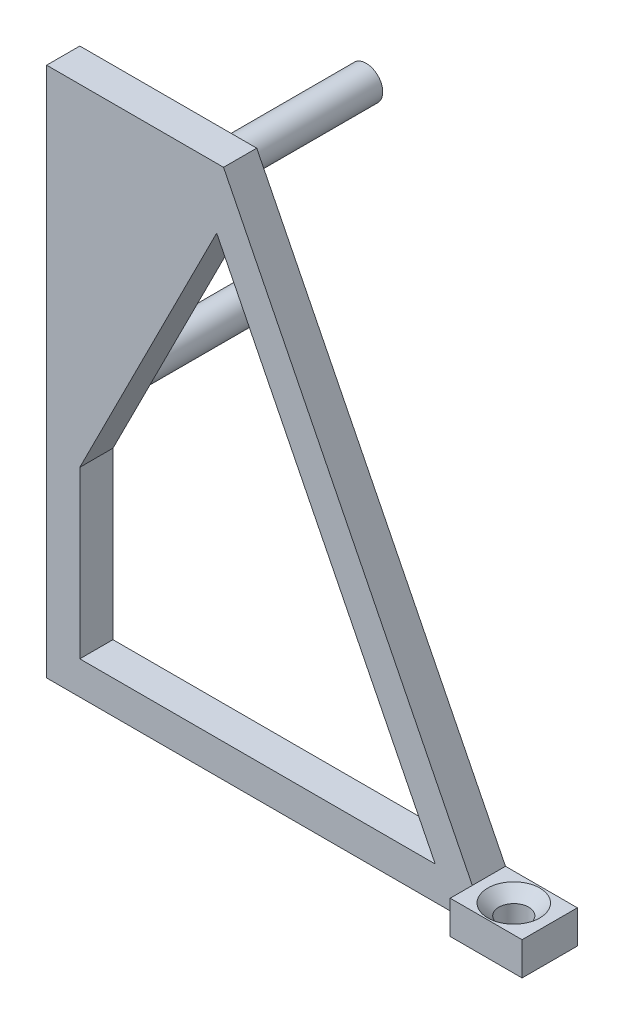
ISO-10303-21;
HEADER;
FILE_DESCRIPTION(('STEP AP214'),'2;1');
FILE_NAME('part.step','',(''),(''),'','','');
FILE_SCHEMA(('AUTOMOTIVE_DESIGN { 1 0 10303 214 1 1 1 1 }'));
ENDSEC;
DATA;
#1=APPLICATION_CONTEXT('core data for automotive mechanical design processes');
#2=APPLICATION_PROTOCOL_DEFINITION('international standard','automotive_design',2000,#1);
#3=PRODUCT_CONTEXT('',#1,'mechanical');
#4=PRODUCT('Part','Part','',(#3));
#5=PRODUCT_RELATED_PRODUCT_CATEGORY('part','',(#4));
#6=PRODUCT_DEFINITION_FORMATION('','',#4);
#7=PRODUCT_DEFINITION_CONTEXT('part definition',#1,'design');
#8=PRODUCT_DEFINITION('design','',#6,#7);
#9=PRODUCT_DEFINITION_SHAPE('','',#8);
#10=(LENGTH_UNIT() NAMED_UNIT(*) SI_UNIT(.MILLI.,.METRE.));
#11=(NAMED_UNIT(*) PLANE_ANGLE_UNIT() SI_UNIT($,.RADIAN.));
#12=(NAMED_UNIT(*) SI_UNIT($,.STERADIAN.) SOLID_ANGLE_UNIT());
#13=UNCERTAINTY_MEASURE_WITH_UNIT(LENGTH_MEASURE(1.E-05),#10,'distance_accuracy_value','');
#14=(GEOMETRIC_REPRESENTATION_CONTEXT(3) GLOBAL_UNCERTAINTY_ASSIGNED_CONTEXT((#13)) GLOBAL_UNIT_ASSIGNED_CONTEXT((#10,
#11,#12)) REPRESENTATION_CONTEXT('',''));
#15=CARTESIAN_POINT('',(0.,0.,0.));
#16=DIRECTION('',(0.,0.,1.));
#17=DIRECTION('',(1.,0.,0.));
#18=AXIS2_PLACEMENT_3D('',#15,#16,#17);
#19=CARTESIAN_POINT('',(0.,0.,3.));
#20=DIRECTION('',(0.,0.,1.));
#21=DIRECTION('',(1.,0.,0.));
#22=AXIS2_PLACEMENT_3D('',#19,#20,#21);
#23=PLANE('',#22);
#24=DIRECTION('',(0.,-1.,0.));
#25=VECTOR('',#24,1.);
#26=CARTESIAN_POINT('',(38.5,3.,3.));
#27=LINE('',#26,#25);
#28=CARTESIAN_POINT('',(38.5,2.99999999999999,3.));
#29=VERTEX_POINT('',#28);
#30=CARTESIAN_POINT('',(38.5,0.,3.));
#31=VERTEX_POINT('',#30);
#32=EDGE_CURVE('E151',#29,#31,#27,.T.);
#33=ORIENTED_EDGE('',*,*,#32,.F.);
#34=DIRECTION('',(-0.447213595499958,0.894427190999916,0.));
#35=VECTOR('',#34,1.);
#36=CARTESIAN_POINT('',(16.,48.,3.));
#37=LINE('',#36,#35);
#38=CARTESIAN_POINT('',(16.,48.,3.));
#39=VERTEX_POINT('',#38);
#40=EDGE_CURVE('E204',#29,#39,#37,.T.);
#41=ORIENTED_EDGE('',*,*,#40,.T.);
#42=DIRECTION('',(-1.,0.,0.));
#43=VECTOR('',#42,1.);
#44=CARTESIAN_POINT('',(0.,48.,3.));
#45=LINE('',#44,#43);
#46=CARTESIAN_POINT('',(0.,48.,3.));
#47=VERTEX_POINT('',#46);
#48=EDGE_CURVE('E207',#39,#47,#45,.T.);
#49=ORIENTED_EDGE('',*,*,#48,.T.);
#50=DIRECTION('',(0.,-1.,0.));
#51=VECTOR('',#50,1.);
#52=CARTESIAN_POINT('',(0.,0.,3.));
#53=LINE('',#52,#51);
#54=CARTESIAN_POINT('',(0.,0.,3.));
#55=VERTEX_POINT('',#54);
#56=EDGE_CURVE('E209',#47,#55,#53,.T.);
#57=ORIENTED_EDGE('',*,*,#56,.T.);
#58=DIRECTION('',(1.,0.,0.));
#59=VECTOR('',#58,1.);
#60=CARTESIAN_POINT('',(0.,0.,3.));
#61=LINE('',#60,#59);
#62=EDGE_CURVE('E202',#55,#31,#61,.T.);
#63=ORIENTED_EDGE('',*,*,#62,.T.);
#64=EDGE_LOOP('',(#33,#41,#49,#57,#63));
#65=FACE_BOUND('',#64,.T.);
#66=DIRECTION('',(1.,0.,0.));
#67=VECTOR('',#66,1.);
#68=CARTESIAN_POINT('',(3.,3.,3.));
#69=LINE('',#68,#67);
#70=CARTESIAN_POINT('',(3.,3.,3.));
#71=VERTEX_POINT('',#70);
#72=CARTESIAN_POINT('',(35.1458980337503,3.,3.));
#73=VERTEX_POINT('',#72);
#74=EDGE_CURVE('E178',#71,#73,#69,.T.);
#75=ORIENTED_EDGE('',*,*,#74,.F.);
#76=DIRECTION('',(0.,-1.,0.));
#77=VECTOR('',#76,1.);
#78=CARTESIAN_POINT('',(3.,3.,3.));
#79=LINE('',#78,#77);
#80=CARTESIAN_POINT('',(3.,18.,3.));
#81=VERTEX_POINT('',#80);
#82=EDGE_CURVE('E176',#81,#71,#79,.T.);
#83=ORIENTED_EDGE('',*,*,#82,.F.);
#84=DIRECTION('',(-0.450431679441175,-0.892810899438287,0.));
#85=VECTOR('',#84,1.);
#86=CARTESIAN_POINT('',(3.,18.,3.));
#87=LINE('',#86,#85);
#88=CARTESIAN_POINT('',(15.3782712398091,42.5352535878825,3.));
#89=VERTEX_POINT('',#88);
#90=EDGE_CURVE('E183',#89,#81,#87,.T.);
#91=ORIENTED_EDGE('',*,*,#90,.F.);
#92=DIRECTION('',(-0.447213595499958,0.894427190999916,0.));
#93=VECTOR('',#92,1.);
#94=CARTESIAN_POINT('',(15.3782712398091,42.5352535878825,3.));
#95=LINE('',#94,#93);
#96=EDGE_CURVE('E181',#73,#89,#95,.T.);
#97=ORIENTED_EDGE('',*,*,#96,.F.);
#98=EDGE_LOOP('',(#75,#83,#91,#97));
#99=FACE_BOUND('',#98,.T.);
#100=ADVANCED_FACE('F35',(#65,#99),#23,.T.);
#101=CARTESIAN_POINT('',(0.,0.,0.));
#102=DIRECTION('',(0.,0.,1.));
#103=DIRECTION('',(1.,0.,0.));
#104=AXIS2_PLACEMENT_3D('',#101,#102,#103);
#105=PLANE('',#104);
#106=DIRECTION('',(1.,0.,0.));
#107=VECTOR('',#106,1.);
#108=CARTESIAN_POINT('',(40.,0.,0.));
#109=LINE('',#108,#107);
#110=CARTESIAN_POINT('',(0.,0.,0.));
#111=VERTEX_POINT('',#110);
#112=CARTESIAN_POINT('',(45.,0.,0.));
#113=VERTEX_POINT('',#112);
#114=EDGE_CURVE('E201',#111,#113,#109,.T.);
#115=ORIENTED_EDGE('',*,*,#114,.F.);
#116=DIRECTION('',(0.,-1.,0.));
#117=VECTOR('',#116,1.);
#118=CARTESIAN_POINT('',(0.,0.,0.));
#119=LINE('',#118,#117);
#120=CARTESIAN_POINT('',(0.,48.,0.));
#121=VERTEX_POINT('',#120);
#122=EDGE_CURVE('E205',#121,#111,#119,.T.);
#123=ORIENTED_EDGE('',*,*,#122,.F.);
#124=DIRECTION('',(-1.,0.,0.));
#125=VECTOR('',#124,1.);
#126=CARTESIAN_POINT('',(0.,48.,0.));
#127=LINE('',#126,#125);
#128=CARTESIAN_POINT('',(16.,48.,0.));
#129=VERTEX_POINT('',#128);
#130=EDGE_CURVE('E218',#129,#121,#127,.T.);
#131=ORIENTED_EDGE('',*,*,#130,.F.);
#132=DIRECTION('',(-0.447213595499958,0.894427190999916,0.));
#133=VECTOR('',#132,1.);
#134=CARTESIAN_POINT('',(16.,48.,0.));
#135=LINE('',#134,#133);
#136=CARTESIAN_POINT('',(38.5,2.99999999999999,0.));
#137=VERTEX_POINT('',#136);
#138=EDGE_CURVE('E216',#137,#129,#135,.T.);
#139=ORIENTED_EDGE('',*,*,#138,.F.);
#140=DIRECTION('',(-1.,0.,0.));
#141=VECTOR('',#140,1.);
#142=CARTESIAN_POINT('',(45.,3.,0.));
#143=LINE('',#142,#141);
#144=CARTESIAN_POINT('',(45.,3.,0.));
#145=VERTEX_POINT('',#144);
#146=EDGE_CURVE('E214',#145,#137,#143,.T.);
#147=ORIENTED_EDGE('',*,*,#146,.F.);
#148=DIRECTION('',(0.,1.,0.));
#149=VECTOR('',#148,1.);
#150=CARTESIAN_POINT('',(45.,0.,0.));
#151=LINE('',#150,#149);
#152=EDGE_CURVE('E131',#113,#145,#151,.T.);
#153=ORIENTED_EDGE('',*,*,#152,.F.);
#154=EDGE_LOOP('',(#115,#123,#131,#139,#147,#153));
#155=FACE_BOUND('',#154,.T.);
#156=DIRECTION('',(0.,-1.,0.));
#157=VECTOR('',#156,1.);
#158=CARTESIAN_POINT('',(3.,3.,0.));
#159=LINE('',#158,#157);
#160=CARTESIAN_POINT('',(3.,18.,0.));
#161=VERTEX_POINT('',#160);
#162=CARTESIAN_POINT('',(3.,3.,0.));
#163=VERTEX_POINT('',#162);
#164=EDGE_CURVE('E59',#161,#163,#159,.T.);
#165=ORIENTED_EDGE('',*,*,#164,.T.);
#166=DIRECTION('',(1.,0.,0.));
#167=VECTOR('',#166,1.);
#168=CARTESIAN_POINT('',(3.,3.,0.));
#169=LINE('',#168,#167);
#170=CARTESIAN_POINT('',(35.1458980337503,3.,0.));
#171=VERTEX_POINT('',#170);
#172=EDGE_CURVE('E187',#163,#171,#169,.T.);
#173=ORIENTED_EDGE('',*,*,#172,.T.);
#174=DIRECTION('',(-0.447213595499958,0.894427190999916,0.));
#175=VECTOR('',#174,1.);
#176=CARTESIAN_POINT('',(15.3782712398091,42.5352535878825,0.));
#177=LINE('',#176,#175);
#178=CARTESIAN_POINT('',(15.3782712398091,42.5352535878825,0.));
#179=VERTEX_POINT('',#178);
#180=EDGE_CURVE('E190',#171,#179,#177,.T.);
#181=ORIENTED_EDGE('',*,*,#180,.T.);
#182=DIRECTION('',(-0.450431679441175,-0.892810899438287,0.));
#183=VECTOR('',#182,1.);
#184=CARTESIAN_POINT('',(3.,18.,0.));
#185=LINE('',#184,#183);
#186=EDGE_CURVE('E179',#179,#161,#185,.T.);
#187=ORIENTED_EDGE('',*,*,#186,.T.);
#188=EDGE_LOOP('',(#165,#173,#181,#187));
#189=FACE_BOUND('',#188,.T.);
#190=CARTESIAN_POINT('',(12.9,45.1,0.));
#191=DIRECTION('',(0.,0.,1.));
#192=DIRECTION('',(1.,0.,0.));
#193=AXIS2_PLACEMENT_3D('',#190,#191,#192);
#194=CIRCLE('',#193,1.5);
#195=CARTESIAN_POINT('',(14.4,45.1,0.));
#196=VERTEX_POINT('',#195);
#197=EDGE_CURVE('E173',#196,#196,#194,.T.);
#198=ORIENTED_EDGE('',*,*,#197,.T.);
#199=EDGE_LOOP('',(#198));
#200=FACE_BOUND('',#199,.T.);
#201=CARTESIAN_POINT('',(2.5,22.9,0.));
#202=DIRECTION('',(0.,0.,1.));
#203=DIRECTION('',(1.,0.,0.));
#204=AXIS2_PLACEMENT_3D('',#201,#202,#203);
#205=CIRCLE('',#204,1.5);
#206=CARTESIAN_POINT('',(4.,22.9,0.));
#207=VERTEX_POINT('',#206);
#208=EDGE_CURVE('E167',#207,#207,#205,.T.);
#209=ORIENTED_EDGE('',*,*,#208,.T.);
#210=EDGE_LOOP('',(#209));
#211=FACE_BOUND('',#210,.T.);
#212=ADVANCED_FACE('F246',(#155,#189,#200,#211),#105,.F.);
#213=CARTESIAN_POINT('',(40.,0.,3.));
#214=DIRECTION('',(0.,1.,0.));
#215=DIRECTION('',(0.,0.,1.));
#216=AXIS2_PLACEMENT_3D('',#213,#214,#215);
#217=PLANE('',#216);
#218=CARTESIAN_POINT('',(41.75,0.,2.5));
#219=DIRECTION('',(0.,1.,0.));
#220=DIRECTION('',(-1.,0.,0.));
#221=AXIS2_PLACEMENT_3D('',#218,#219,#220);
#222=CIRCLE('',#221,1.35);
#223=CARTESIAN_POINT('',(40.4,0.,2.5));
#224=VERTEX_POINT('',#223);
#225=EDGE_CURVE('E154',#224,#224,#222,.T.);
#226=ORIENTED_EDGE('',*,*,#225,.T.);
#227=EDGE_LOOP('',(#226));
#228=FACE_BOUND('',#227,.T.);
#229=ORIENTED_EDGE('',*,*,#114,.T.);
#230=DIRECTION('',(0.,0.,-1.));
#231=VECTOR('',#230,1.);
#232=CARTESIAN_POINT('',(45.,0.,3.));
#233=LINE('',#232,#231);
#234=CARTESIAN_POINT('',(45.,0.,5.));
#235=VERTEX_POINT('',#234);
#236=EDGE_CURVE('E134',#235,#113,#233,.T.);
#237=ORIENTED_EDGE('',*,*,#236,.F.);
#238=DIRECTION('',(1.,0.,0.));
#239=VECTOR('',#238,1.);
#240=CARTESIAN_POINT('',(45.,0.,5.));
#241=LINE('',#240,#239);
#242=CARTESIAN_POINT('',(38.5,0.,5.));
#243=VERTEX_POINT('',#242);
#244=EDGE_CURVE('E150',#243,#235,#241,.T.);
#245=ORIENTED_EDGE('',*,*,#244,.F.);
#246=DIRECTION('',(0.,0.,-1.));
#247=VECTOR('',#246,1.);
#248=CARTESIAN_POINT('',(38.5,0.,5.));
#249=LINE('',#248,#247);
#250=EDGE_CURVE('E159',#243,#31,#249,.T.);
#251=ORIENTED_EDGE('',*,*,#250,.T.);
#252=ORIENTED_EDGE('',*,*,#62,.F.);
#253=DIRECTION('',(0.,0.,-1.));
#254=VECTOR('',#253,1.);
#255=CARTESIAN_POINT('',(0.,0.,3.));
#256=LINE('',#255,#254);
#257=EDGE_CURVE('E211',#55,#111,#256,.T.);
#258=ORIENTED_EDGE('',*,*,#257,.T.);
#259=EDGE_LOOP('',(#229,#237,#245,#251,#252,#258));
#260=FACE_BOUND('',#259,.T.);
#261=ADVANCED_FACE('F252',(#228,#260),#217,.F.);
#262=CARTESIAN_POINT('',(45.,0.,3.));
#263=DIRECTION('',(-1.,0.,0.));
#264=DIRECTION('',(0.,0.,1.));
#265=AXIS2_PLACEMENT_3D('',#262,#263,#264);
#266=PLANE('',#265);
#267=ORIENTED_EDGE('',*,*,#152,.T.);
#268=DIRECTION('',(0.,0.,-1.));
#269=VECTOR('',#268,1.);
#270=CARTESIAN_POINT('',(45.,3.,3.));
#271=LINE('',#270,#269);
#272=CARTESIAN_POINT('',(45.,3.,5.));
#273=VERTEX_POINT('',#272);
#274=EDGE_CURVE('E124',#273,#145,#271,.T.);
#275=ORIENTED_EDGE('',*,*,#274,.F.);
#276=DIRECTION('',(0.,1.,0.));
#277=VECTOR('',#276,1.);
#278=CARTESIAN_POINT('',(45.,3.,5.));
#279=LINE('',#278,#277);
#280=EDGE_CURVE('E129',#235,#273,#279,.T.);
#281=ORIENTED_EDGE('',*,*,#280,.F.);
#282=ORIENTED_EDGE('',*,*,#236,.T.);
#283=EDGE_LOOP('',(#267,#275,#281,#282));
#284=FACE_BOUND('',#283,.T.);
#285=ADVANCED_FACE('F126',(#284),#266,.F.);
#286=CARTESIAN_POINT('',(45.,3.,3.));
#287=DIRECTION('',(0.,-1.,0.));
#288=DIRECTION('',(1.,0.,0.));
#289=AXIS2_PLACEMENT_3D('',#286,#287,#288);
#290=PLANE('',#289);
#291=CARTESIAN_POINT('',(41.75,3.,2.5));
#292=DIRECTION('',(0.,-1.,0.));
#293=DIRECTION('',(1.,0.,0.));
#294=AXIS2_PLACEMENT_3D('',#291,#292,#293);
#295=CIRCLE('',#294,2.34999999999999);
#296=CARTESIAN_POINT('',(44.1,3.,2.5));
#297=VERTEX_POINT('',#296);
#298=EDGE_CURVE('E11',#297,#297,#295,.T.);
#299=ORIENTED_EDGE('',*,*,#298,.T.);
#300=EDGE_LOOP('',(#299));
#301=FACE_BOUND('',#300,.T.);
#302=ORIENTED_EDGE('',*,*,#146,.T.);
#303=DIRECTION('',(0.,0.,-1.));
#304=VECTOR('',#303,1.);
#305=CARTESIAN_POINT('',(38.5,2.99999999999999,3.));
#306=LINE('',#305,#304);
#307=EDGE_CURVE('E135',#29,#137,#306,.T.);
#308=ORIENTED_EDGE('',*,*,#307,.F.);
#309=DIRECTION('',(0.,0.,-1.));
#310=VECTOR('',#309,1.);
#311=CARTESIAN_POINT('',(38.5,3.,5.));
#312=LINE('',#311,#310);
#313=CARTESIAN_POINT('',(38.5,3.,5.));
#314=VERTEX_POINT('',#313);
#315=EDGE_CURVE('E142',#314,#29,#312,.T.);
#316=ORIENTED_EDGE('',*,*,#315,.F.);
#317=DIRECTION('',(-1.,0.,0.));
#318=VECTOR('',#317,1.);
#319=CARTESIAN_POINT('',(45.,3.,5.));
#320=LINE('',#319,#318);
#321=EDGE_CURVE('E138',#273,#314,#320,.T.);
#322=ORIENTED_EDGE('',*,*,#321,.F.);
#323=ORIENTED_EDGE('',*,*,#274,.T.);
#324=EDGE_LOOP('',(#302,#308,#316,#322,#323));
#325=FACE_BOUND('',#324,.T.);
#326=ADVANCED_FACE('F139',(#301,#325),#290,.F.);
#327=CARTESIAN_POINT('',(16.,48.,3.));
#328=DIRECTION('',(-0.894427190999916,-0.447213595499958,0.));
#329=DIRECTION('',(0.447213595499958,-0.894427190999916,0.));
#330=AXIS2_PLACEMENT_3D('',#327,#328,#329);
#331=PLANE('',#330);
#332=ORIENTED_EDGE('',*,*,#138,.T.);
#333=DIRECTION('',(0.,0.,-1.));
#334=VECTOR('',#333,1.);
#335=CARTESIAN_POINT('',(16.,48.,3.));
#336=LINE('',#335,#334);
#337=EDGE_CURVE('E227',#39,#129,#336,.T.);
#338=ORIENTED_EDGE('',*,*,#337,.F.);
#339=ORIENTED_EDGE('',*,*,#40,.F.);
#340=ORIENTED_EDGE('',*,*,#307,.T.);
#341=EDGE_LOOP('',(#332,#338,#339,#340));
#342=FACE_BOUND('',#341,.T.);
#343=ADVANCED_FACE('F267',(#342),#331,.F.);
#344=CARTESIAN_POINT('',(0.,48.,3.));
#345=DIRECTION('',(0.,-1.,0.));
#346=DIRECTION('',(0.,0.,-1.));
#347=AXIS2_PLACEMENT_3D('',#344,#345,#346);
#348=PLANE('',#347);
#349=ORIENTED_EDGE('',*,*,#130,.T.);
#350=DIRECTION('',(0.,0.,-1.));
#351=VECTOR('',#350,1.);
#352=CARTESIAN_POINT('',(0.,48.,3.));
#353=LINE('',#352,#351);
#354=EDGE_CURVE('E224',#47,#121,#353,.T.);
#355=ORIENTED_EDGE('',*,*,#354,.F.);
#356=ORIENTED_EDGE('',*,*,#48,.F.);
#357=ORIENTED_EDGE('',*,*,#337,.T.);
#358=EDGE_LOOP('',(#349,#355,#356,#357));
#359=FACE_BOUND('',#358,.T.);
#360=ADVANCED_FACE('F263',(#359),#348,.F.);
#361=CARTESIAN_POINT('',(0.,0.,3.));
#362=DIRECTION('',(1.,0.,0.));
#363=DIRECTION('',(0.,0.,-1.));
#364=AXIS2_PLACEMENT_3D('',#361,#362,#363);
#365=PLANE('',#364);
#366=ORIENTED_EDGE('',*,*,#122,.T.);
#367=ORIENTED_EDGE('',*,*,#257,.F.);
#368=ORIENTED_EDGE('',*,*,#56,.F.);
#369=ORIENTED_EDGE('',*,*,#354,.T.);
#370=EDGE_LOOP('',(#366,#367,#368,#369));
#371=FACE_BOUND('',#370,.T.);
#372=ADVANCED_FACE('F260',(#371),#365,.F.);
#373=CARTESIAN_POINT('',(3.,3.,3.));
#374=DIRECTION('',(1.,0.,0.));
#375=DIRECTION('',(0.,0.,-1.));
#376=AXIS2_PLACEMENT_3D('',#373,#374,#375);
#377=PLANE('',#376);
#378=ORIENTED_EDGE('',*,*,#164,.F.);
#379=DIRECTION('',(0.,0.,-1.));
#380=VECTOR('',#379,1.);
#381=CARTESIAN_POINT('',(3.,18.,3.));
#382=LINE('',#381,#380);
#383=EDGE_CURVE('E185',#81,#161,#382,.T.);
#384=ORIENTED_EDGE('',*,*,#383,.F.);
#385=ORIENTED_EDGE('',*,*,#82,.T.);
#386=DIRECTION('',(0.,0.,-1.));
#387=VECTOR('',#386,1.);
#388=CARTESIAN_POINT('',(3.,3.,3.));
#389=LINE('',#388,#387);
#390=EDGE_CURVE('E199',#71,#163,#389,.T.);
#391=ORIENTED_EDGE('',*,*,#390,.T.);
#392=EDGE_LOOP('',(#378,#384,#385,#391));
#393=FACE_BOUND('',#392,.T.);
#394=ADVANCED_FACE('F257',(#393),#377,.T.);
#395=CARTESIAN_POINT('',(3.,3.,3.));
#396=DIRECTION('',(0.,1.,0.));
#397=DIRECTION('',(0.,0.,1.));
#398=AXIS2_PLACEMENT_3D('',#395,#396,#397);
#399=PLANE('',#398);
#400=ORIENTED_EDGE('',*,*,#172,.F.);
#401=ORIENTED_EDGE('',*,*,#390,.F.);
#402=ORIENTED_EDGE('',*,*,#74,.T.);
#403=DIRECTION('',(0.,0.,-1.));
#404=VECTOR('',#403,1.);
#405=CARTESIAN_POINT('',(35.1458980337503,3.,3.));
#406=LINE('',#405,#404);
#407=EDGE_CURVE('E197',#73,#171,#406,.T.);
#408=ORIENTED_EDGE('',*,*,#407,.T.);
#409=EDGE_LOOP('',(#400,#401,#402,#408));
#410=FACE_BOUND('',#409,.T.);
#411=ADVANCED_FACE('F325',(#410),#399,.T.);
#412=CARTESIAN_POINT('',(15.3782712398091,42.5352535878825,3.));
#413=DIRECTION('',(-0.894427190999916,-0.447213595499958,0.));
#414=DIRECTION('',(0.447213595499958,-0.894427190999916,0.));
#415=AXIS2_PLACEMENT_3D('',#412,#413,#414);
#416=PLANE('',#415);
#417=ORIENTED_EDGE('',*,*,#180,.F.);
#418=ORIENTED_EDGE('',*,*,#407,.F.);
#419=ORIENTED_EDGE('',*,*,#96,.T.);
#420=DIRECTION('',(0.,0.,-1.));
#421=VECTOR('',#420,1.);
#422=CARTESIAN_POINT('',(15.3782712398091,42.5352535878825,3.));
#423=LINE('',#422,#421);
#424=EDGE_CURVE('E51',#89,#179,#423,.T.);
#425=ORIENTED_EDGE('',*,*,#424,.T.);
#426=EDGE_LOOP('',(#417,#418,#419,#425));
#427=FACE_BOUND('',#426,.T.);
#428=ADVANCED_FACE('F323',(#427),#416,.T.);
#429=CARTESIAN_POINT('',(3.,18.,3.));
#430=DIRECTION('',(0.892810899438287,-0.450431679441175,0.));
#431=DIRECTION('',(0.450431679441175,0.892810899438287,0.));
#432=AXIS2_PLACEMENT_3D('',#429,#430,#431);
#433=PLANE('',#432);
#434=ORIENTED_EDGE('',*,*,#186,.F.);
#435=ORIENTED_EDGE('',*,*,#424,.F.);
#436=ORIENTED_EDGE('',*,*,#90,.T.);
#437=ORIENTED_EDGE('',*,*,#383,.T.);
#438=EDGE_LOOP('',(#434,#435,#436,#437));
#439=FACE_BOUND('',#438,.T.);
#440=ADVANCED_FACE('F319',(#439),#433,.T.);
#441=CARTESIAN_POINT('',(12.9,45.1,3.));
#442=DIRECTION('',(0.,0.,-1.));
#443=DIRECTION('',(-1.,0.,0.));
#444=AXIS2_PLACEMENT_3D('',#441,#442,#443);
#445=CYLINDRICAL_SURFACE('',#444,1.5);
#446=CARTESIAN_POINT('',(12.9,45.1,-13.));
#447=DIRECTION('',(0.,0.,-1.));
#448=DIRECTION('',(-1.,0.,0.));
#449=AXIS2_PLACEMENT_3D('',#446,#447,#448);
#450=CIRCLE('',#449,1.5);
#451=CARTESIAN_POINT('',(11.4,45.1,-13.));
#452=VERTEX_POINT('',#451);
#453=EDGE_CURVE('E170',#452,#452,#450,.T.);
#454=ORIENTED_EDGE('',*,*,#453,.F.);
#455=EDGE_LOOP('',(#454));
#456=FACE_BOUND('',#455,.T.);
#457=ORIENTED_EDGE('',*,*,#197,.F.);
#458=EDGE_LOOP('',(#457));
#459=FACE_BOUND('',#458,.T.);
#460=ADVANCED_FACE('F315',(#456,#459),#445,.T.);
#461=CARTESIAN_POINT('',(12.9,45.1,-13.));
#462=DIRECTION('',(0.,0.,-1.));
#463=DIRECTION('',(-1.,0.,0.));
#464=AXIS2_PLACEMENT_3D('',#461,#462,#463);
#465=PLANE('',#464);
#466=ORIENTED_EDGE('',*,*,#453,.T.);
#467=EDGE_LOOP('',(#466));
#468=FACE_BOUND('',#467,.T.);
#469=ADVANCED_FACE('F311',(#468),#465,.T.);
#470=CARTESIAN_POINT('',(2.5,22.9,3.));
#471=DIRECTION('',(0.,0.,-1.));
#472=DIRECTION('',(-1.,0.,0.));
#473=AXIS2_PLACEMENT_3D('',#470,#471,#472);
#474=CYLINDRICAL_SURFACE('',#473,1.5);
#475=CARTESIAN_POINT('',(2.5,22.9,-13.));
#476=DIRECTION('',(0.,0.,-1.));
#477=DIRECTION('',(-1.,0.,0.));
#478=AXIS2_PLACEMENT_3D('',#475,#476,#477);
#479=CIRCLE('',#478,1.5);
#480=CARTESIAN_POINT('',(0.999999999999998,22.9,-13.));
#481=VERTEX_POINT('',#480);
#482=EDGE_CURVE('E164',#481,#481,#479,.T.);
#483=ORIENTED_EDGE('',*,*,#482,.F.);
#484=EDGE_LOOP('',(#483));
#485=FACE_BOUND('',#484,.T.);
#486=ORIENTED_EDGE('',*,*,#208,.F.);
#487=EDGE_LOOP('',(#486));
#488=FACE_BOUND('',#487,.T.);
#489=ADVANCED_FACE('F305',(#485,#488),#474,.T.);
#490=CARTESIAN_POINT('',(2.5,22.9,-13.));
#491=DIRECTION('',(0.,0.,-1.));
#492=DIRECTION('',(-1.,0.,0.));
#493=AXIS2_PLACEMENT_3D('',#490,#491,#492);
#494=PLANE('',#493);
#495=ORIENTED_EDGE('',*,*,#482,.T.);
#496=EDGE_LOOP('',(#495));
#497=FACE_BOUND('',#496,.T.);
#498=ADVANCED_FACE('F298',(#497),#494,.T.);
#499=CARTESIAN_POINT('',(38.5,3.,5.));
#500=DIRECTION('',(1.,0.,0.));
#501=DIRECTION('',(0.,0.,-1.));
#502=AXIS2_PLACEMENT_3D('',#499,#500,#501);
#503=PLANE('',#502);
#504=ORIENTED_EDGE('',*,*,#32,.T.);
#505=ORIENTED_EDGE('',*,*,#250,.F.);
#506=DIRECTION('',(0.,-1.,0.));
#507=VECTOR('',#506,1.);
#508=CARTESIAN_POINT('',(38.5,3.,5.));
#509=LINE('',#508,#507);
#510=EDGE_CURVE('E145',#314,#243,#509,.T.);
#511=ORIENTED_EDGE('',*,*,#510,.F.);
#512=ORIENTED_EDGE('',*,*,#315,.T.);
#513=EDGE_LOOP('',(#504,#505,#511,#512));
#514=FACE_BOUND('',#513,.T.);
#515=ADVANCED_FACE('F293',(#514),#503,.F.);
#516=CARTESIAN_POINT('',(0.,0.,5.));
#517=DIRECTION('',(0.,0.,-1.));
#518=DIRECTION('',(-1.,0.,0.));
#519=AXIS2_PLACEMENT_3D('',#516,#517,#518);
#520=PLANE('',#519);
#521=ORIENTED_EDGE('',*,*,#280,.T.);
#522=ORIENTED_EDGE('',*,*,#321,.T.);
#523=ORIENTED_EDGE('',*,*,#510,.T.);
#524=ORIENTED_EDGE('',*,*,#244,.T.);
#525=EDGE_LOOP('',(#521,#522,#523,#524));
#526=FACE_BOUND('',#525,.T.);
#527=ADVANCED_FACE('F148',(#526),#520,.F.);
#528=CARTESIAN_POINT('',(41.75,0.,2.5));
#529=DIRECTION('',(0.,1.,0.));
#530=DIRECTION('',(-1.,0.,0.));
#531=AXIS2_PLACEMENT_3D('',#528,#529,#530);
#532=CYLINDRICAL_SURFACE('',#531,1.35);
#533=CARTESIAN_POINT('',(41.75,2.00000000000001,2.5));
#534=DIRECTION('',(0.,-1.,0.));
#535=DIRECTION('',(0.,0.,-1.));
#536=AXIS2_PLACEMENT_3D('',#533,#534,#535);
#537=CIRCLE('',#536,1.35);
#538=CARTESIAN_POINT('',(41.75,2.00000000000001,1.15));
#539=VERTEX_POINT('',#538);
#540=EDGE_CURVE('E44',#539,#539,#537,.F.);
#541=ORIENTED_EDGE('',*,*,#540,.T.);
#542=EDGE_LOOP('',(#541));
#543=FACE_BOUND('',#542,.T.);
#544=ORIENTED_EDGE('',*,*,#225,.F.);
#545=EDGE_LOOP('',(#544));
#546=FACE_BOUND('',#545,.T.);
#547=ADVANCED_FACE('F235',(#543,#546),#532,.F.);
#548=CARTESIAN_POINT('',(41.75,2.00000000000001,2.5));
#549=DIRECTION('',(0.,1.,0.));
#550=DIRECTION('',(0.,0.,1.));
#551=AXIS2_PLACEMENT_3D('',#548,#549,#550);
#552=CONICAL_SURFACE('',#551,1.35,0.785398163397451);
#553=ORIENTED_EDGE('',*,*,#298,.F.);
#554=EDGE_LOOP('',(#553));
#555=FACE_BOUND('',#554,.T.);
#556=ORIENTED_EDGE('',*,*,#540,.F.);
#557=EDGE_LOOP('',(#556));
#558=FACE_BOUND('',#557,.T.);
#559=ADVANCED_FACE('F38',(#555,#558),#552,.F.);
#560=CLOSED_SHELL('',(#100,#212,#261,#285,#326,#343,#360,#372,#394,#411,#428,#440,#460,#469,
#489,#498,#515,#527,#547,#559));
#561=MANIFOLD_SOLID_BREP('B2',#560);
#562=ADVANCED_BREP_SHAPE_REPRESENTATION('',(#18,#561),#14);
#563=SHAPE_DEFINITION_REPRESENTATION(#9,#562);
ENDSEC;
END-ISO-10303-21;
